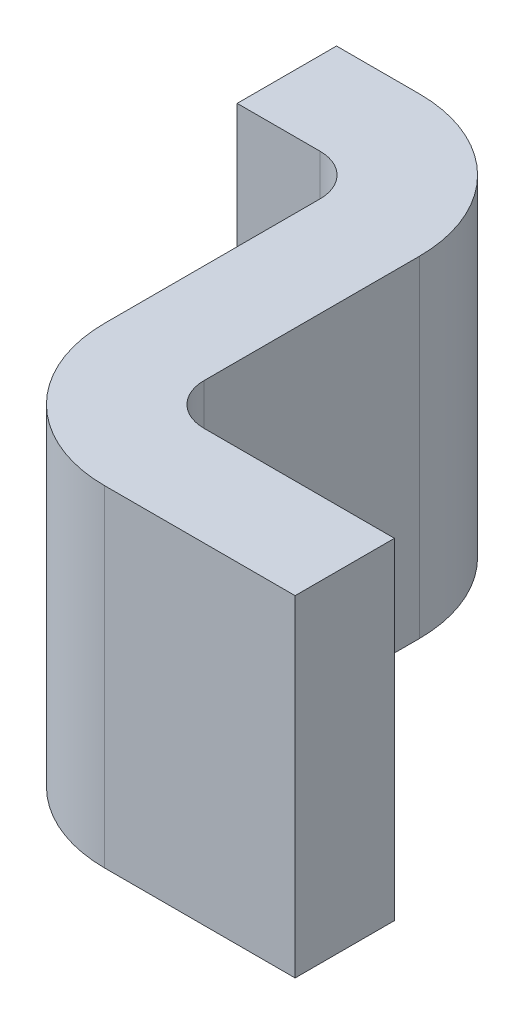
ISO-10303-21;
HEADER;
FILE_DESCRIPTION(('STEP AP214'),'2;1');
FILE_NAME('part.step','',(''),(''),'','','');
FILE_SCHEMA(('AUTOMOTIVE_DESIGN { 1 0 10303 214 1 1 1 1 }'));
ENDSEC;
DATA;
#1=APPLICATION_CONTEXT('core data for automotive mechanical design processes');
#2=APPLICATION_PROTOCOL_DEFINITION('international standard','automotive_design',2000,#1);
#3=PRODUCT_CONTEXT('',#1,'mechanical');
#4=PRODUCT('Part','Part','',(#3));
#5=PRODUCT_RELATED_PRODUCT_CATEGORY('part','',(#4));
#6=PRODUCT_DEFINITION_FORMATION('','',#4);
#7=PRODUCT_DEFINITION_CONTEXT('part definition',#1,'design');
#8=PRODUCT_DEFINITION('design','',#6,#7);
#9=PRODUCT_DEFINITION_SHAPE('','',#8);
#10=(LENGTH_UNIT() NAMED_UNIT(*) SI_UNIT(.MILLI.,.METRE.));
#11=(NAMED_UNIT(*) PLANE_ANGLE_UNIT() SI_UNIT($,.RADIAN.));
#12=(NAMED_UNIT(*) SI_UNIT($,.STERADIAN.) SOLID_ANGLE_UNIT());
#13=UNCERTAINTY_MEASURE_WITH_UNIT(LENGTH_MEASURE(1.E-05),#10,'distance_accuracy_value','');
#14=(GEOMETRIC_REPRESENTATION_CONTEXT(3) GLOBAL_UNCERTAINTY_ASSIGNED_CONTEXT((#13)) GLOBAL_UNIT_ASSIGNED_CONTEXT((#10,
#11,#12)) REPRESENTATION_CONTEXT('',''));
#15=CARTESIAN_POINT('',(0.,0.,0.));
#16=DIRECTION('',(0.,0.,1.));
#17=DIRECTION('',(1.,0.,0.));
#18=AXIS2_PLACEMENT_3D('',#15,#16,#17);
#19=CARTESIAN_POINT('',(5.4,-2.2,-7.43));
#20=DIRECTION('',(0.,1.,0.));
#21=DIRECTION('',(0.,0.,1.));
#22=AXIS2_PLACEMENT_3D('',#19,#20,#21);
#23=CYLINDRICAL_SURFACE('',#22,0.0499999999999994);
#24=DIRECTION('',(0.,-1.,0.));
#25=VECTOR('',#24,1.);
#26=CARTESIAN_POINT('',(5.45,-2.,-7.43));
#27=LINE('',#26,#25);
#28=CARTESIAN_POINT('',(5.45,-1.8,-7.43));
#29=VERTEX_POINT('',#28);
#30=CARTESIAN_POINT('',(5.45,-2.2,-7.43));
#31=VERTEX_POINT('',#30);
#32=EDGE_CURVE('E167',#29,#31,#27,.T.);
#33=ORIENTED_EDGE('',*,*,#32,.F.);
#34=CARTESIAN_POINT('',(5.4,-1.8,-7.43));
#35=DIRECTION('',(0.,1.,0.));
#36=DIRECTION('',(0.,0.,1.));
#37=AXIS2_PLACEMENT_3D('',#34,#35,#36);
#38=CIRCLE('',#37,0.0499999999999994);
#39=CARTESIAN_POINT('',(5.4,-1.8,-7.48));
#40=VERTEX_POINT('',#39);
#41=EDGE_CURVE('E201',#40,#29,#38,.F.);
#42=ORIENTED_EDGE('',*,*,#41,.F.);
#43=DIRECTION('',(0.,1.,0.));
#44=VECTOR('',#43,1.);
#45=CARTESIAN_POINT('',(5.4,-2.,-7.48));
#46=LINE('',#45,#44);
#47=CARTESIAN_POINT('',(5.4,-2.2,-7.48));
#48=VERTEX_POINT('',#47);
#49=EDGE_CURVE('E169',#48,#40,#46,.T.);
#50=ORIENTED_EDGE('',*,*,#49,.F.);
#51=CARTESIAN_POINT('',(5.4,-2.2,-7.43));
#52=DIRECTION('',(0.,1.,0.));
#53=DIRECTION('',(0.,0.,1.));
#54=AXIS2_PLACEMENT_3D('',#51,#52,#53);
#55=CIRCLE('',#54,0.0499999999999994);
#56=EDGE_CURVE('E178',#31,#48,#55,.T.);
#57=ORIENTED_EDGE('',*,*,#56,.F.);
#58=EDGE_LOOP('',(#33,#42,#50,#57));
#59=FACE_BOUND('',#58,.T.);
#60=ADVANCED_FACE('F17',(#59),#23,.F.);
#61=CARTESIAN_POINT('',(5.45,-2.201,-7.431));
#62=DIRECTION('',(-1.,0.,0.));
#63=DIRECTION('',(0.,0.,1.));
#64=AXIS2_PLACEMENT_3D('',#61,#62,#63);
#65=PLANE('',#64);
#66=DIRECTION('',(0.,-1.,0.));
#67=VECTOR('',#66,1.);
#68=CARTESIAN_POINT('',(5.45,-2.,-7.17));
#69=LINE('',#68,#67);
#70=CARTESIAN_POINT('',(5.45,-1.8,-7.17));
#71=VERTEX_POINT('',#70);
#72=CARTESIAN_POINT('',(5.45,-2.2,-7.17));
#73=VERTEX_POINT('',#72);
#74=EDGE_CURVE('E165',#71,#73,#69,.T.);
#75=ORIENTED_EDGE('',*,*,#74,.F.);
#76=DIRECTION('',(0.,0.,1.));
#77=VECTOR('',#76,1.);
#78=CARTESIAN_POINT('',(5.45,-1.8,-7.3));
#79=LINE('',#78,#77);
#80=EDGE_CURVE('E200',#29,#71,#79,.T.);
#81=ORIENTED_EDGE('',*,*,#80,.F.);
#82=ORIENTED_EDGE('',*,*,#32,.T.);
#83=DIRECTION('',(0.,0.,-1.));
#84=VECTOR('',#83,1.);
#85=CARTESIAN_POINT('',(5.45,-2.2,-7.3));
#86=LINE('',#85,#84);
#87=EDGE_CURVE('E205',#73,#31,#86,.T.);
#88=ORIENTED_EDGE('',*,*,#87,.F.);
#89=EDGE_LOOP('',(#75,#81,#82,#88));
#90=FACE_BOUND('',#89,.T.);
#91=ADVANCED_FACE('F249',(#90),#65,.T.);
#92=CARTESIAN_POINT('',(5.62,-1.8,-7.17));
#93=DIRECTION('',(0.,-1.,0.));
#94=DIRECTION('',(0.,0.,-1.));
#95=AXIS2_PLACEMENT_3D('',#92,#93,#94);
#96=CYLINDRICAL_SURFACE('',#95,0.169999999999999);
#97=DIRECTION('',(0.,-1.,0.));
#98=VECTOR('',#97,1.);
#99=CARTESIAN_POINT('',(5.62,-2.,-7.));
#100=LINE('',#99,#98);
#101=CARTESIAN_POINT('',(5.62,-1.8,-7.));
#102=VERTEX_POINT('',#101);
#103=CARTESIAN_POINT('',(5.62,-2.2,-7.));
#104=VERTEX_POINT('',#103);
#105=EDGE_CURVE('E161',#102,#104,#100,.T.);
#106=ORIENTED_EDGE('',*,*,#105,.F.);
#107=CARTESIAN_POINT('',(5.62,-1.8,-7.17));
#108=DIRECTION('',(0.,-1.,0.));
#109=DIRECTION('',(0.,0.,-1.));
#110=AXIS2_PLACEMENT_3D('',#107,#108,#109);
#111=CIRCLE('',#110,0.169999999999999);
#112=EDGE_CURVE('E197',#71,#102,#111,.F.);
#113=ORIENTED_EDGE('',*,*,#112,.F.);
#114=ORIENTED_EDGE('',*,*,#74,.T.);
#115=CARTESIAN_POINT('',(5.62,-2.2,-7.17));
#116=DIRECTION('',(0.,-1.,0.));
#117=DIRECTION('',(0.,0.,-1.));
#118=AXIS2_PLACEMENT_3D('',#115,#116,#117);
#119=CIRCLE('',#118,0.169999999999999);
#120=EDGE_CURVE('E206',#104,#73,#119,.T.);
#121=ORIENTED_EDGE('',*,*,#120,.F.);
#122=EDGE_LOOP('',(#106,#113,#114,#121));
#123=FACE_BOUND('',#122,.T.);
#124=ADVANCED_FACE('F252',(#123),#96,.T.);
#125=CARTESIAN_POINT('',(5.619,-2.201,-7.));
#126=DIRECTION('',(0.,0.,1.));
#127=DIRECTION('',(1.,0.,0.));
#128=AXIS2_PLACEMENT_3D('',#125,#126,#127);
#129=PLANE('',#128);
#130=DIRECTION('',(0.,-1.,0.));
#131=VECTOR('',#130,1.);
#132=CARTESIAN_POINT('',(5.85,-2.,-7.));
#133=LINE('',#132,#131);
#134=CARTESIAN_POINT('',(5.85,-1.8,-7.));
#135=VERTEX_POINT('',#134);
#136=CARTESIAN_POINT('',(5.85,-2.2,-7.));
#137=VERTEX_POINT('',#136);
#138=EDGE_CURVE('E150',#135,#137,#133,.T.);
#139=ORIENTED_EDGE('',*,*,#138,.F.);
#140=DIRECTION('',(1.,0.,0.));
#141=VECTOR('',#140,1.);
#142=CARTESIAN_POINT('',(5.575,-1.8,-7.));
#143=LINE('',#142,#141);
#144=EDGE_CURVE('E157',#102,#135,#143,.T.);
#145=ORIENTED_EDGE('',*,*,#144,.F.);
#146=ORIENTED_EDGE('',*,*,#105,.T.);
#147=DIRECTION('',(-1.,0.,0.));
#148=VECTOR('',#147,1.);
#149=CARTESIAN_POINT('',(5.575,-2.2,-7.));
#150=LINE('',#149,#148);
#151=EDGE_CURVE('E188',#137,#104,#150,.T.);
#152=ORIENTED_EDGE('',*,*,#151,.F.);
#153=EDGE_LOOP('',(#139,#145,#146,#152));
#154=FACE_BOUND('',#153,.T.);
#155=ADVANCED_FACE('F256',(#154),#129,.T.);
#156=CARTESIAN_POINT('',(5.85,-2.201,-6.999));
#157=DIRECTION('',(1.,0.,0.));
#158=DIRECTION('',(0.,0.,-1.));
#159=AXIS2_PLACEMENT_3D('',#156,#157,#158);
#160=PLANE('',#159);
#161=DIRECTION('',(0.,-1.,0.));
#162=VECTOR('',#161,1.);
#163=CARTESIAN_POINT('',(5.85,-2.,-7.12));
#164=LINE('',#163,#162);
#165=CARTESIAN_POINT('',(5.85,-1.8,-7.12));
#166=VERTEX_POINT('',#165);
#167=CARTESIAN_POINT('',(5.85,-2.2,-7.12));
#168=VERTEX_POINT('',#167);
#169=EDGE_CURVE('E148',#166,#168,#164,.T.);
#170=ORIENTED_EDGE('',*,*,#169,.F.);
#171=DIRECTION('',(0.,0.,-1.));
#172=VECTOR('',#171,1.);
#173=CARTESIAN_POINT('',(5.85,-1.8,-7.3));
#174=LINE('',#173,#172);
#175=EDGE_CURVE('E153',#135,#166,#174,.T.);
#176=ORIENTED_EDGE('',*,*,#175,.F.);
#177=ORIENTED_EDGE('',*,*,#138,.T.);
#178=DIRECTION('',(0.,0.,1.));
#179=VECTOR('',#178,1.);
#180=CARTESIAN_POINT('',(5.85,-2.2,-7.3));
#181=LINE('',#180,#179);
#182=EDGE_CURVE('E185',#168,#137,#181,.T.);
#183=ORIENTED_EDGE('',*,*,#182,.F.);
#184=EDGE_LOOP('',(#170,#176,#177,#183));
#185=FACE_BOUND('',#184,.T.);
#186=ADVANCED_FACE('F260',(#185),#160,.T.);
#187=CARTESIAN_POINT('',(5.851,-2.201,-7.12));
#188=DIRECTION('',(0.,0.,-1.));
#189=DIRECTION('',(-1.,0.,0.));
#190=AXIS2_PLACEMENT_3D('',#187,#188,#189);
#191=PLANE('',#190);
#192=DIRECTION('',(0.,-1.,0.));
#193=VECTOR('',#192,1.);
#194=CARTESIAN_POINT('',(5.62,-2.,-7.12));
#195=LINE('',#194,#193);
#196=CARTESIAN_POINT('',(5.62,-1.8,-7.12));
#197=VERTEX_POINT('',#196);
#198=CARTESIAN_POINT('',(5.62,-2.2,-7.12));
#199=VERTEX_POINT('',#198);
#200=EDGE_CURVE('E146',#197,#199,#195,.T.);
#201=ORIENTED_EDGE('',*,*,#200,.F.);
#202=DIRECTION('',(-1.,0.,0.));
#203=VECTOR('',#202,1.);
#204=CARTESIAN_POINT('',(5.575,-1.8,-7.12));
#205=LINE('',#204,#203);
#206=EDGE_CURVE('E156',#166,#197,#205,.T.);
#207=ORIENTED_EDGE('',*,*,#206,.F.);
#208=ORIENTED_EDGE('',*,*,#169,.T.);
#209=DIRECTION('',(1.,0.,0.));
#210=VECTOR('',#209,1.);
#211=CARTESIAN_POINT('',(5.575,-2.2,-7.12));
#212=LINE('',#211,#210);
#213=EDGE_CURVE('E189',#199,#168,#212,.T.);
#214=ORIENTED_EDGE('',*,*,#213,.F.);
#215=EDGE_LOOP('',(#201,#207,#208,#214));
#216=FACE_BOUND('',#215,.T.);
#217=ADVANCED_FACE('F263',(#216),#191,.T.);
#218=CARTESIAN_POINT('',(5.62,-2.2,-7.17));
#219=DIRECTION('',(0.,1.,0.));
#220=DIRECTION('',(0.,0.,1.));
#221=AXIS2_PLACEMENT_3D('',#218,#219,#220);
#222=CYLINDRICAL_SURFACE('',#221,0.0499999999999995);
#223=DIRECTION('',(0.,-1.,0.));
#224=VECTOR('',#223,1.);
#225=CARTESIAN_POINT('',(5.57,-2.,-7.17));
#226=LINE('',#225,#224);
#227=CARTESIAN_POINT('',(5.57,-1.8,-7.17));
#228=VERTEX_POINT('',#227);
#229=CARTESIAN_POINT('',(5.57,-2.2,-7.17));
#230=VERTEX_POINT('',#229);
#231=EDGE_CURVE('E117',#228,#230,#226,.T.);
#232=ORIENTED_EDGE('',*,*,#231,.F.);
#233=CARTESIAN_POINT('',(5.62,-1.8,-7.17));
#234=DIRECTION('',(0.,1.,0.));
#235=DIRECTION('',(0.,0.,1.));
#236=AXIS2_PLACEMENT_3D('',#233,#234,#235);
#237=CIRCLE('',#236,0.0499999999999995);
#238=EDGE_CURVE('E194',#197,#228,#237,.F.);
#239=ORIENTED_EDGE('',*,*,#238,.F.);
#240=ORIENTED_EDGE('',*,*,#200,.T.);
#241=CARTESIAN_POINT('',(5.62,-2.2,-7.17));
#242=DIRECTION('',(0.,1.,0.));
#243=DIRECTION('',(0.,0.,1.));
#244=AXIS2_PLACEMENT_3D('',#241,#242,#243);
#245=CIRCLE('',#244,0.0499999999999995);
#246=EDGE_CURVE('E125',#230,#199,#245,.T.);
#247=ORIENTED_EDGE('',*,*,#246,.F.);
#248=EDGE_LOOP('',(#232,#239,#240,#247));
#249=FACE_BOUND('',#248,.T.);
#250=ADVANCED_FACE('F266',(#249),#222,.F.);
#251=CARTESIAN_POINT('',(5.57,-2.201,-7.169));
#252=DIRECTION('',(1.,0.,0.));
#253=DIRECTION('',(0.,0.,-1.));
#254=AXIS2_PLACEMENT_3D('',#251,#252,#253);
#255=PLANE('',#254);
#256=DIRECTION('',(0.,-1.,0.));
#257=VECTOR('',#256,1.);
#258=CARTESIAN_POINT('',(5.57,-2.,-7.43));
#259=LINE('',#258,#257);
#260=CARTESIAN_POINT('',(5.57,-1.8,-7.43));
#261=VERTEX_POINT('',#260);
#262=CARTESIAN_POINT('',(5.57,-2.2,-7.43));
#263=VERTEX_POINT('',#262);
#264=EDGE_CURVE('E107',#261,#263,#259,.T.);
#265=ORIENTED_EDGE('',*,*,#264,.F.);
#266=DIRECTION('',(0.,0.,-1.));
#267=VECTOR('',#266,1.);
#268=CARTESIAN_POINT('',(5.57,-1.8,-7.3));
#269=LINE('',#268,#267);
#270=EDGE_CURVE('E193',#228,#261,#269,.T.);
#271=ORIENTED_EDGE('',*,*,#270,.F.);
#272=ORIENTED_EDGE('',*,*,#231,.T.);
#273=DIRECTION('',(0.,0.,1.));
#274=VECTOR('',#273,1.);
#275=CARTESIAN_POINT('',(5.57,-2.2,-7.3));
#276=LINE('',#275,#274);
#277=EDGE_CURVE('E120',#263,#230,#276,.T.);
#278=ORIENTED_EDGE('',*,*,#277,.F.);
#279=EDGE_LOOP('',(#265,#271,#272,#278));
#280=FACE_BOUND('',#279,.T.);
#281=ADVANCED_FACE('F121',(#280),#255,.T.);
#282=CARTESIAN_POINT('',(5.4,-1.8,-7.43));
#283=DIRECTION('',(0.,-1.,0.));
#284=DIRECTION('',(0.,0.,-1.));
#285=AXIS2_PLACEMENT_3D('',#282,#283,#284);
#286=CYLINDRICAL_SURFACE('',#285,0.17);
#287=DIRECTION('',(0.,-1.,0.));
#288=VECTOR('',#287,1.);
#289=CARTESIAN_POINT('',(5.4,-2.,-7.6));
#290=LINE('',#289,#288);
#291=CARTESIAN_POINT('',(5.4,-1.8,-7.6));
#292=VERTEX_POINT('',#291);
#293=CARTESIAN_POINT('',(5.4,-2.2,-7.6));
#294=VERTEX_POINT('',#293);
#295=EDGE_CURVE('E102',#292,#294,#290,.T.);
#296=ORIENTED_EDGE('',*,*,#295,.F.);
#297=CARTESIAN_POINT('',(5.4,-1.8,-7.43));
#298=DIRECTION('',(0.,-1.,0.));
#299=DIRECTION('',(0.,0.,-1.));
#300=AXIS2_PLACEMENT_3D('',#297,#298,#299);
#301=CIRCLE('',#300,0.17);
#302=EDGE_CURVE('E113',#261,#292,#301,.F.);
#303=ORIENTED_EDGE('',*,*,#302,.F.);
#304=ORIENTED_EDGE('',*,*,#264,.T.);
#305=CARTESIAN_POINT('',(5.4,-2.2,-7.43));
#306=DIRECTION('',(0.,-1.,0.));
#307=DIRECTION('',(0.,0.,-1.));
#308=AXIS2_PLACEMENT_3D('',#305,#306,#307);
#309=CIRCLE('',#308,0.17);
#310=EDGE_CURVE('E21',#294,#263,#309,.T.);
#311=ORIENTED_EDGE('',*,*,#310,.F.);
#312=EDGE_LOOP('',(#296,#303,#304,#311));
#313=FACE_BOUND('',#312,.T.);
#314=ADVANCED_FACE('F109',(#313),#286,.T.);
#315=CARTESIAN_POINT('',(5.401,-2.201,-7.6));
#316=DIRECTION('',(0.,0.,-1.));
#317=DIRECTION('',(-1.,0.,0.));
#318=AXIS2_PLACEMENT_3D('',#315,#316,#317);
#319=PLANE('',#318);
#320=DIRECTION('',(0.,-1.,0.));
#321=VECTOR('',#320,1.);
#322=CARTESIAN_POINT('',(5.3,-2.,-7.6));
#323=LINE('',#322,#321);
#324=CARTESIAN_POINT('',(5.3,-1.8,-7.6));
#325=VERTEX_POINT('',#324);
#326=CARTESIAN_POINT('',(5.3,-2.2,-7.6));
#327=VERTEX_POINT('',#326);
#328=EDGE_CURVE('E136',#325,#327,#323,.T.);
#329=ORIENTED_EDGE('',*,*,#328,.F.);
#330=DIRECTION('',(-1.,0.,0.));
#331=VECTOR('',#330,1.);
#332=CARTESIAN_POINT('',(5.575,-1.8,-7.6));
#333=LINE('',#332,#331);
#334=EDGE_CURVE('E140',#292,#325,#333,.T.);
#335=ORIENTED_EDGE('',*,*,#334,.F.);
#336=ORIENTED_EDGE('',*,*,#295,.T.);
#337=DIRECTION('',(1.,0.,0.));
#338=VECTOR('',#337,1.);
#339=CARTESIAN_POINT('',(5.575,-2.2,-7.6));
#340=LINE('',#339,#338);
#341=EDGE_CURVE('E129',#327,#294,#340,.T.);
#342=ORIENTED_EDGE('',*,*,#341,.F.);
#343=EDGE_LOOP('',(#329,#335,#336,#342));
#344=FACE_BOUND('',#343,.T.);
#345=ADVANCED_FACE('F287',(#344),#319,.T.);
#346=CARTESIAN_POINT('',(5.299,-2.2,-6.999));
#347=DIRECTION('',(0.,-1.,0.));
#348=DIRECTION('',(0.,0.,-1.));
#349=AXIS2_PLACEMENT_3D('',#346,#347,#348);
#350=PLANE('',#349);
#351=DIRECTION('',(1.,0.,0.));
#352=VECTOR('',#351,1.);
#353=CARTESIAN_POINT('',(5.35,-2.2,-7.48));
#354=LINE('',#353,#352);
#355=CARTESIAN_POINT('',(5.3,-2.2,-7.48));
#356=VERTEX_POINT('',#355);
#357=EDGE_CURVE('E171',#356,#48,#354,.T.);
#358=ORIENTED_EDGE('',*,*,#357,.F.);
#359=DIRECTION('',(0.,0.,1.));
#360=VECTOR('',#359,1.);
#361=CARTESIAN_POINT('',(5.3,-2.2,-7.54));
#362=LINE('',#361,#360);
#363=EDGE_CURVE('E139',#327,#356,#362,.T.);
#364=ORIENTED_EDGE('',*,*,#363,.F.);
#365=ORIENTED_EDGE('',*,*,#341,.T.);
#366=ORIENTED_EDGE('',*,*,#310,.T.);
#367=ORIENTED_EDGE('',*,*,#277,.T.);
#368=ORIENTED_EDGE('',*,*,#246,.T.);
#369=ORIENTED_EDGE('',*,*,#213,.T.);
#370=ORIENTED_EDGE('',*,*,#182,.T.);
#371=ORIENTED_EDGE('',*,*,#151,.T.);
#372=ORIENTED_EDGE('',*,*,#120,.T.);
#373=ORIENTED_EDGE('',*,*,#87,.T.);
#374=ORIENTED_EDGE('',*,*,#56,.T.);
#375=EDGE_LOOP('',(#358,#364,#365,#366,#367,#368,#369,#370,#371,#372,#373,#374));
#376=FACE_BOUND('',#375,.T.);
#377=ADVANCED_FACE('F127',(#376),#350,.T.);
#378=CARTESIAN_POINT('',(5.299,-2.201,-7.48));
#379=DIRECTION('',(0.,0.,1.));
#380=DIRECTION('',(1.,0.,0.));
#381=AXIS2_PLACEMENT_3D('',#378,#379,#380);
#382=PLANE('',#381);
#383=ORIENTED_EDGE('',*,*,#49,.T.);
#384=DIRECTION('',(1.,0.,0.));
#385=VECTOR('',#384,1.);
#386=CARTESIAN_POINT('',(5.575,-1.8,-7.48));
#387=LINE('',#386,#385);
#388=CARTESIAN_POINT('',(5.3,-1.8,-7.48));
#389=VERTEX_POINT('',#388);
#390=EDGE_CURVE('E36',#389,#40,#387,.T.);
#391=ORIENTED_EDGE('',*,*,#390,.F.);
#392=DIRECTION('',(0.,1.,0.));
#393=VECTOR('',#392,1.);
#394=CARTESIAN_POINT('',(5.3,-2.,-7.48));
#395=LINE('',#394,#393);
#396=EDGE_CURVE('E27',#356,#389,#395,.T.);
#397=ORIENTED_EDGE('',*,*,#396,.F.);
#398=ORIENTED_EDGE('',*,*,#357,.T.);
#399=EDGE_LOOP('',(#383,#391,#397,#398));
#400=FACE_BOUND('',#399,.T.);
#401=ADVANCED_FACE('F240',(#400),#382,.T.);
#402=CARTESIAN_POINT('',(5.299,-1.8,-7.601));
#403=DIRECTION('',(0.,1.,0.));
#404=DIRECTION('',(0.,0.,1.));
#405=AXIS2_PLACEMENT_3D('',#402,#403,#404);
#406=PLANE('',#405);
#407=ORIENTED_EDGE('',*,*,#302,.T.);
#408=ORIENTED_EDGE('',*,*,#334,.T.);
#409=DIRECTION('',(0.,0.,-1.));
#410=VECTOR('',#409,1.);
#411=CARTESIAN_POINT('',(5.3,-1.8,-7.54));
#412=LINE('',#411,#410);
#413=EDGE_CURVE('E11',#389,#325,#412,.T.);
#414=ORIENTED_EDGE('',*,*,#413,.F.);
#415=ORIENTED_EDGE('',*,*,#390,.T.);
#416=ORIENTED_EDGE('',*,*,#41,.T.);
#417=ORIENTED_EDGE('',*,*,#80,.T.);
#418=ORIENTED_EDGE('',*,*,#112,.T.);
#419=ORIENTED_EDGE('',*,*,#144,.T.);
#420=ORIENTED_EDGE('',*,*,#175,.T.);
#421=ORIENTED_EDGE('',*,*,#206,.T.);
#422=ORIENTED_EDGE('',*,*,#238,.T.);
#423=ORIENTED_EDGE('',*,*,#270,.T.);
#424=EDGE_LOOP('',(#407,#408,#414,#415,#416,#417,#418,#419,#420,#421,#422,#423));
#425=FACE_BOUND('',#424,.T.);
#426=ADVANCED_FACE('F237',(#425),#406,.T.);
#427=CARTESIAN_POINT('',(5.3,-2.201,-7.601));
#428=DIRECTION('',(-1.,0.,0.));
#429=DIRECTION('',(0.,0.,1.));
#430=AXIS2_PLACEMENT_3D('',#427,#428,#429);
#431=PLANE('',#430);
#432=ORIENTED_EDGE('',*,*,#396,.T.);
#433=ORIENTED_EDGE('',*,*,#413,.T.);
#434=ORIENTED_EDGE('',*,*,#328,.T.);
#435=ORIENTED_EDGE('',*,*,#363,.T.);
#436=EDGE_LOOP('',(#432,#433,#434,#435));
#437=FACE_BOUND('',#436,.T.);
#438=ADVANCED_FACE('F19',(#437),#431,.T.);
#439=CLOSED_SHELL('',(#60,#91,#124,#155,#186,#217,#250,#281,#314,#345,#377,#401,#426,#438));
#440=MANIFOLD_SOLID_BREP('B1',#439);
#441=ADVANCED_BREP_SHAPE_REPRESENTATION('',(#18,#440),#14);
#442=SHAPE_DEFINITION_REPRESENTATION(#9,#441);
ENDSEC;
END-ISO-10303-21;
